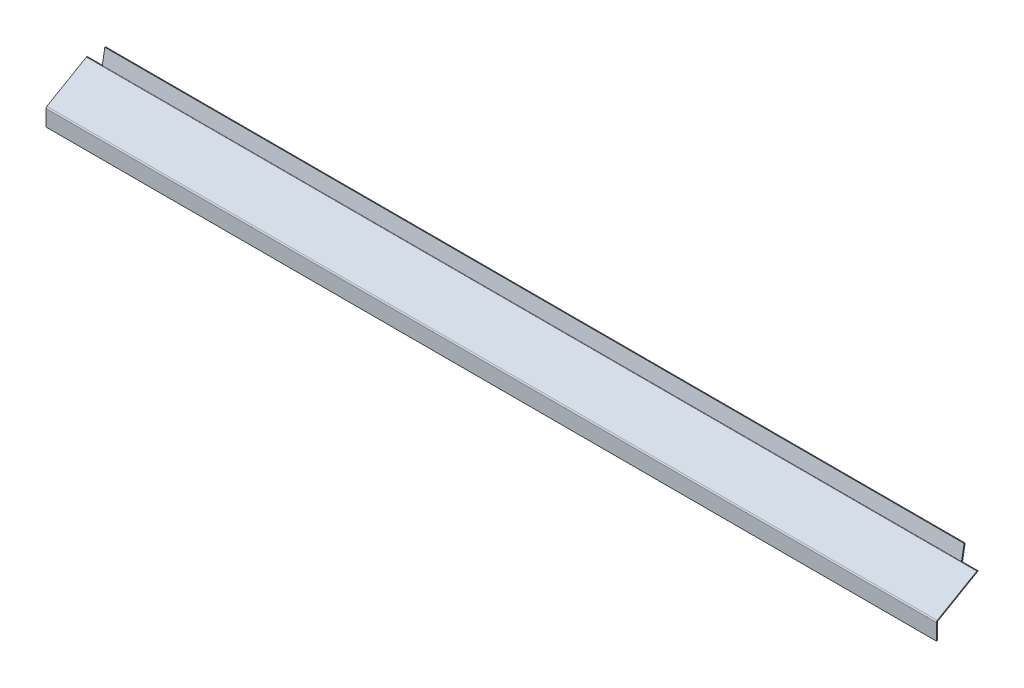
ISO-10303-21;
HEADER;
FILE_DESCRIPTION(('STEP AP214'),'2;1');
FILE_NAME('part.step','',(''),(''),'','','');
FILE_SCHEMA(('AUTOMOTIVE_DESIGN { 1 0 10303 214 1 1 1 1 }'));
ENDSEC;
DATA;
#1=APPLICATION_CONTEXT('core data for automotive mechanical design processes');
#2=APPLICATION_PROTOCOL_DEFINITION('international standard','automotive_design',2000,#1);
#3=PRODUCT_CONTEXT('',#1,'mechanical');
#4=PRODUCT('Part','Part','',(#3));
#5=PRODUCT_RELATED_PRODUCT_CATEGORY('part','',(#4));
#6=PRODUCT_DEFINITION_FORMATION('','',#4);
#7=PRODUCT_DEFINITION_CONTEXT('part definition',#1,'design');
#8=PRODUCT_DEFINITION('design','',#6,#7);
#9=PRODUCT_DEFINITION_SHAPE('','',#8);
#10=(LENGTH_UNIT() NAMED_UNIT(*) SI_UNIT(.MILLI.,.METRE.));
#11=(NAMED_UNIT(*) PLANE_ANGLE_UNIT() SI_UNIT($,.RADIAN.));
#12=(NAMED_UNIT(*) SI_UNIT($,.STERADIAN.) SOLID_ANGLE_UNIT());
#13=UNCERTAINTY_MEASURE_WITH_UNIT(LENGTH_MEASURE(1.E-05),#10,'distance_accuracy_value','');
#14=(GEOMETRIC_REPRESENTATION_CONTEXT(3) GLOBAL_UNCERTAINTY_ASSIGNED_CONTEXT((#13)) GLOBAL_UNIT_ASSIGNED_CONTEXT((#10,
#11,#12)) REPRESENTATION_CONTEXT('',''));
#15=CARTESIAN_POINT('',(0.,0.,0.));
#16=DIRECTION('',(0.,0.,1.));
#17=DIRECTION('',(1.,0.,0.));
#18=AXIS2_PLACEMENT_3D('',#15,#16,#17);
#19=CARTESIAN_POINT('',(-514.999999999999,37.1351085053024,-46.3624559304882));
#20=DIRECTION('',(-1.,0.,0.));
#21=DIRECTION('',(0.,-0.173648177666931,-0.984807753012208));
#22=AXIS2_PLACEMENT_3D('',#19,#20,#21);
#23=CYLINDRICAL_SURFACE('',#22,1.9366);
#24=CARTESIAN_POINT('',(-515.,37.1351085053024,-46.3624559304882));
#25=DIRECTION('',(-1.,0.,0.));
#26=DIRECTION('',(0.,0.,1.));
#27=AXIS2_PLACEMENT_3D('',#24,#25,#26);
#28=CIRCLE('',#27,1.9366);
#29=CARTESIAN_POINT('',(-515.,36.2577170242714,-48.0888984430018));
#30=VERTEX_POINT('',#29);
#31=CARTESIAN_POINT('',(-515.,35.4579637083334,-47.3307559304882));
#32=VERTEX_POINT('',#31);
#33=EDGE_CURVE('E292',#30,#32,#28,.T.);
#34=ORIENTED_EDGE('',*,*,#33,.F.);
#35=DIRECTION('',(-1.,0.,0.));
#36=VECTOR('',#35,1.);
#37=CARTESIAN_POINT('',(-514.999999999999,36.2577170242714,-48.0888984430018));
#38=LINE('',#37,#36);
#39=CARTESIAN_POINT('',(-497.,36.2577170242714,-48.0888984430018));
#40=VERTEX_POINT('',#39);
#41=EDGE_CURVE('E109',#40,#30,#38,.T.);
#42=ORIENTED_EDGE('',*,*,#41,.F.);
#43=CARTESIAN_POINT('',(-497.,37.1351085053024,-46.3624559304882));
#44=DIRECTION('',(1.,0.,0.));
#45=DIRECTION('',(0.,0.,-1.));
#46=AXIS2_PLACEMENT_3D('',#43,#44,#45);
#47=CIRCLE('',#46,1.9366);
#48=CARTESIAN_POINT('',(-497.,36.7988214444325,-48.2696346249717));
#49=VERTEX_POINT('',#48);
#50=EDGE_CURVE('E219',#49,#40,#47,.F.);
#51=ORIENTED_EDGE('',*,*,#50,.F.);
#52=DIRECTION('',(-1.,0.,0.));
#53=VECTOR('',#52,1.);
#54=CARTESIAN_POINT('',(0.,36.7988214444326,-48.2696346249717));
#55=LINE('',#54,#53);
#56=CARTESIAN_POINT('',(497.,36.7988214444326,-48.2696346249717));
#57=VERTEX_POINT('',#56);
#58=EDGE_CURVE('E280',#57,#49,#55,.T.);
#59=ORIENTED_EDGE('',*,*,#58,.F.);
#60=CARTESIAN_POINT('',(497.,37.1351085053023,-46.3624559304882));
#61=DIRECTION('',(-1.,0.,0.));
#62=DIRECTION('',(0.,0.,1.));
#63=AXIS2_PLACEMENT_3D('',#60,#61,#62);
#64=CIRCLE('',#63,1.9366);
#65=CARTESIAN_POINT('',(497.,36.2577170242714,-48.0888984430018));
#66=VERTEX_POINT('',#65);
#67=EDGE_CURVE('E260',#57,#66,#64,.T.);
#68=ORIENTED_EDGE('',*,*,#67,.T.);
#69=DIRECTION('',(1.,0.,0.));
#70=VECTOR('',#69,1.);
#71=CARTESIAN_POINT('',(496.999999999999,36.2577170242714,-48.0888984430018));
#72=LINE('',#71,#70);
#73=CARTESIAN_POINT('',(514.999999999999,36.2577170242719,-48.0888984430021));
#74=VERTEX_POINT('',#73);
#75=EDGE_CURVE('E270',#66,#74,#72,.T.);
#76=ORIENTED_EDGE('',*,*,#75,.T.);
#77=CARTESIAN_POINT('',(514.999999999999,37.1351085053024,-46.3624559304882));
#78=DIRECTION('',(-1.,0.,0.));
#79=DIRECTION('',(0.,0.,1.));
#80=AXIS2_PLACEMENT_3D('',#77,#78,#79);
#81=CIRCLE('',#80,1.9366);
#82=CARTESIAN_POINT('',(515.,35.4579637083334,-47.3307559304882));
#83=VERTEX_POINT('',#82);
#84=EDGE_CURVE('E291',#83,#74,#81,.F.);
#85=ORIENTED_EDGE('',*,*,#84,.F.);
#86=DIRECTION('',(-1.,0.,0.));
#87=VECTOR('',#86,1.);
#88=CARTESIAN_POINT('',(-514.999999999999,35.4579637083334,-47.3307559304882));
#89=LINE('',#88,#87);
#90=EDGE_CURVE('E287',#32,#83,#89,.F.);
#91=ORIENTED_EDGE('',*,*,#90,.F.);
#92=EDGE_LOOP('',(#34,#42,#51,#59,#68,#76,#85,#91));
#93=FACE_BOUND('',#92,.T.);
#94=ADVANCED_FACE('F86',(#93),#23,.T.);
#95=CARTESIAN_POINT('',(-514.999999999999,37.1351085053024,-46.3624559304882));
#96=DIRECTION('',(-1.,0.,0.));
#97=DIRECTION('',(0.,-0.173648177666931,-0.984807753012208));
#98=AXIS2_PLACEMENT_3D('',#95,#96,#97);
#99=CYLINDRICAL_SURFACE('',#98,0.736600000000003);
#100=DIRECTION('',(-1.,0.,0.));
#101=VECTOR('',#100,1.);
#102=CARTESIAN_POINT('',(-514.999999999999,36.8013862266039,-47.0191209902412));
#103=LINE('',#102,#101);
#104=CARTESIAN_POINT('',(-497.,36.8013862266039,-47.0191209902412));
#105=VERTEX_POINT('',#104);
#106=CARTESIAN_POINT('',(-515.,36.8013862266039,-47.0191209902412));
#107=VERTEX_POINT('',#106);
#108=EDGE_CURVE('E230',#105,#107,#103,.T.);
#109=ORIENTED_EDGE('',*,*,#108,.T.);
#110=CARTESIAN_POINT('',(-515.,37.1351085053024,-46.3624559304882));
#111=DIRECTION('',(-1.,0.,0.));
#112=DIRECTION('',(0.,0.,1.));
#113=AXIS2_PLACEMENT_3D('',#110,#111,#112);
#114=CIRCLE('',#113,0.736600000000003);
#115=CARTESIAN_POINT('',(-515.,36.4971941928747,-46.7307559304882));
#116=VERTEX_POINT('',#115);
#117=EDGE_CURVE('E284',#107,#116,#114,.T.);
#118=ORIENTED_EDGE('',*,*,#117,.T.);
#119=DIRECTION('',(-1.,0.,0.));
#120=VECTOR('',#119,1.);
#121=CARTESIAN_POINT('',(-514.999999999999,36.4971941928747,-46.7307559304882));
#122=LINE('',#121,#120);
#123=CARTESIAN_POINT('',(515.,36.4971941928747,-46.7307559304882));
#124=VERTEX_POINT('',#123);
#125=EDGE_CURVE('E303',#116,#124,#122,.F.);
#126=ORIENTED_EDGE('',*,*,#125,.T.);
#127=CARTESIAN_POINT('',(515.,37.1351085053024,-46.3624559304882));
#128=DIRECTION('',(-1.,0.,0.));
#129=DIRECTION('',(0.,0.,1.));
#130=AXIS2_PLACEMENT_3D('',#127,#128,#129);
#131=CIRCLE('',#130,0.736600000000003);
#132=CARTESIAN_POINT('',(515.,36.8013862266044,-47.0191209902414));
#133=VERTEX_POINT('',#132);
#134=EDGE_CURVE('E299',#124,#133,#131,.F.);
#135=ORIENTED_EDGE('',*,*,#134,.T.);
#136=DIRECTION('',(1.,0.,0.));
#137=VECTOR('',#136,1.);
#138=CARTESIAN_POINT('',(-1030.00253631797,36.8013862266039,-47.0191209902411));
#139=LINE('',#138,#137);
#140=CARTESIAN_POINT('',(497.,36.8013862266039,-47.0191209902412));
#141=VERTEX_POINT('',#140);
#142=EDGE_CURVE('E264',#141,#133,#139,.T.);
#143=ORIENTED_EDGE('',*,*,#142,.F.);
#144=CARTESIAN_POINT('',(497.,37.1351085053023,-46.3624559304882));
#145=DIRECTION('',(1.,0.,0.));
#146=DIRECTION('',(0.,0.,-1.));
#147=AXIS2_PLACEMENT_3D('',#144,#145,#146);
#148=CIRCLE('',#147,0.7366);
#149=CARTESIAN_POINT('',(497.,37.0071992576329,-47.087865321357));
#150=VERTEX_POINT('',#149);
#151=EDGE_CURVE('E253',#150,#141,#148,.F.);
#152=ORIENTED_EDGE('',*,*,#151,.F.);
#153=DIRECTION('',(1.,0.,0.));
#154=VECTOR('',#153,1.);
#155=CARTESIAN_POINT('',(515.,37.0071992576329,-47.087865321357));
#156=LINE('',#155,#154);
#157=CARTESIAN_POINT('',(-497.,37.0071992576329,-47.087865321357));
#158=VERTEX_POINT('',#157);
#159=EDGE_CURVE('E279',#150,#158,#156,.F.);
#160=ORIENTED_EDGE('',*,*,#159,.T.);
#161=CARTESIAN_POINT('',(-497.,37.1351085053024,-46.3624559304882));
#162=DIRECTION('',(-1.,0.,0.));
#163=DIRECTION('',(0.,0.,1.));
#164=AXIS2_PLACEMENT_3D('',#161,#162,#163);
#165=CIRCLE('',#164,0.736600000000003);
#166=EDGE_CURVE('E234',#158,#105,#165,.T.);
#167=ORIENTED_EDGE('',*,*,#166,.T.);
#168=EDGE_LOOP('',(#109,#118,#126,#135,#143,#152,#160,#167));
#169=FACE_BOUND('',#168,.T.);
#170=ADVANCED_FACE('F451',(#169),#99,.F.);
#171=CARTESIAN_POINT('',(0.,-8.13659562341442,-40.3463082065226));
#172=DIRECTION('',(0.,-0.173648177666931,-0.984807753012208));
#173=DIRECTION('',(0.,0.984807753012208,-0.173648177666931));
#174=AXIS2_PLACEMENT_3D('',#171,#172,#173);
#175=PLANE('',#174);
#176=DIRECTION('',(-1.,0.,0.));
#177=VECTOR('',#176,1.);
#178=CARTESIAN_POINT('',(0.,53.4852741612502,-51.2119064512627));
#179=LINE('',#178,#177);
#180=CARTESIAN_POINT('',(497.,53.4852741612502,-51.2119064512627));
#181=VERTEX_POINT('',#180);
#182=CARTESIAN_POINT('',(-497.,53.4852741612502,-51.2119064512627));
#183=VERTEX_POINT('',#182);
#184=EDGE_CURVE('E101',#181,#183,#179,.T.);
#185=ORIENTED_EDGE('',*,*,#184,.F.);
#186=DIRECTION('',(0.,0.984807753012208,-0.17364817766693));
#187=VECTOR('',#186,1.);
#188=CARTESIAN_POINT('',(497.,-8.1365956234144,-40.3463082065226));
#189=LINE('',#188,#187);
#190=EDGE_CURVE('E276',#181,#57,#189,.F.);
#191=ORIENTED_EDGE('',*,*,#190,.T.);
#192=ORIENTED_EDGE('',*,*,#58,.T.);
#193=DIRECTION('',(0.,0.984807753012208,-0.173648177666931));
#194=VECTOR('',#193,1.);
#195=CARTESIAN_POINT('',(-497.,59.9107568811308,-52.3448924188536));
#196=LINE('',#195,#194);
#197=EDGE_CURVE('E220',#183,#49,#196,.F.);
#198=ORIENTED_EDGE('',*,*,#197,.F.);
#199=EDGE_LOOP('',(#185,#191,#192,#198));
#200=FACE_BOUND('',#199,.T.);
#201=ADVANCED_FACE('F475',(#200),#175,.T.);
#202=CARTESIAN_POINT('',(0.,-7.9282178102141,-39.1645389029079));
#203=DIRECTION('',(0.,-0.173648177666931,-0.984807753012208));
#204=DIRECTION('',(0.,0.984807753012208,-0.173648177666931));
#205=AXIS2_PLACEMENT_3D('',#202,#203,#204);
#206=PLANE('',#205);
#207=DIRECTION('',(0.,-0.984807753012208,0.17364817766693));
#208=VECTOR('',#207,1.);
#209=CARTESIAN_POINT('',(497.,36.4515034247715,-46.9898811529564));
#210=LINE('',#209,#208);
#211=CARTESIAN_POINT('',(497.,53.6936519744505,-50.0301371476481));
#212=VERTEX_POINT('',#211);
#213=EDGE_CURVE('E210',#212,#150,#210,.T.);
#214=ORIENTED_EDGE('',*,*,#213,.F.);
#215=DIRECTION('',(1.,0.,0.));
#216=VECTOR('',#215,1.);
#217=CARTESIAN_POINT('',(-515.,53.6936519744505,-50.0301371476481));
#218=LINE('',#217,#216);
#219=CARTESIAN_POINT('',(-497.,53.6936519744505,-50.0301371476481));
#220=VERTEX_POINT('',#219);
#221=EDGE_CURVE('E199',#220,#212,#218,.T.);
#222=ORIENTED_EDGE('',*,*,#221,.F.);
#223=DIRECTION('',(0.,-0.984807753012208,0.173648177666931));
#224=VECTOR('',#223,1.);
#225=CARTESIAN_POINT('',(-497.,-7.9282178102141,-39.1645389029079));
#226=LINE('',#225,#224);
#227=EDGE_CURVE('E208',#220,#158,#226,.T.);
#228=ORIENTED_EDGE('',*,*,#227,.T.);
#229=ORIENTED_EDGE('',*,*,#159,.F.);
#230=EDGE_LOOP('',(#214,#222,#228,#229));
#231=FACE_BOUND('',#230,.T.);
#232=ADVANCED_FACE('F206',(#231),#206,.F.);
#233=CARTESIAN_POINT('',(-515.,37.1351085053024,-46.3624559304882));
#234=DIRECTION('',(1.,0.,0.));
#235=DIRECTION('',(0.,0.,-1.));
#236=AXIS2_PLACEMENT_3D('',#233,#234,#235);
#237=PLANE('',#236);
#238=ORIENTED_EDGE('',*,*,#117,.F.);
#239=DIRECTION('',(0.,-0.453057668610422,-0.891481210633903));
#240=VECTOR('',#239,1.);
#241=CARTESIAN_POINT('',(-515.,36.2577170242714,-48.0888984430018));
#242=LINE('',#241,#240);
#243=EDGE_CURVE('E240',#30,#107,#242,.F.);
#244=ORIENTED_EDGE('',*,*,#243,.F.);
#245=ORIENTED_EDGE('',*,*,#33,.T.);
#246=DIRECTION('',(0.,-0.866025403784439,-0.5));
#247=VECTOR('',#246,1.);
#248=CARTESIAN_POINT('',(-515.,36.4971941928747,-46.7307559304882));
#249=LINE('',#248,#247);
#250=EDGE_CURVE('E296',#116,#32,#249,.T.);
#251=ORIENTED_EDGE('',*,*,#250,.F.);
#252=EDGE_LOOP('',(#238,#244,#245,#251));
#253=FACE_BOUND('',#252,.T.);
#254=ADVANCED_FACE('F479',(#253),#237,.F.);
#255=CARTESIAN_POINT('',(515.,37.1351085053024,-46.3624559304882));
#256=DIRECTION('',(1.,0.,0.));
#257=DIRECTION('',(0.,0.,-1.));
#258=AXIS2_PLACEMENT_3D('',#255,#256,#257);
#259=PLANE('',#258);
#260=ORIENTED_EDGE('',*,*,#84,.T.);
#261=DIRECTION('',(0.,-0.453057668610419,-0.891481210633904));
#262=VECTOR('',#261,1.);
#263=CARTESIAN_POINT('',(515.,36.2577170242714,-48.0888984430018));
#264=LINE('',#263,#262);
#265=EDGE_CURVE('E267',#133,#74,#264,.T.);
#266=ORIENTED_EDGE('',*,*,#265,.F.);
#267=ORIENTED_EDGE('',*,*,#134,.F.);
#268=DIRECTION('',(6.02890591705213E-13,-0.866025403784439,-0.5));
#269=VECTOR('',#268,1.);
#270=CARTESIAN_POINT('',(515.,36.4971941928747,-46.7307559304882));
#271=LINE('',#270,#269);
#272=EDGE_CURVE('E308',#124,#83,#271,.T.);
#273=ORIENTED_EDGE('',*,*,#272,.T.);
#274=EDGE_LOOP('',(#260,#266,#267,#273));
#275=FACE_BOUND('',#274,.T.);
#276=ADVANCED_FACE('F456',(#275),#259,.T.);
#277=CARTESIAN_POINT('',(515.,37.4521796769726,-48.3848393094365));
#278=DIRECTION('',(-1.,0.,0.));
#279=DIRECTION('',(0.,0.,1.));
#280=AXIS2_PLACEMENT_3D('',#277,#278,#279);
#281=PLANE('',#280);
#282=ORIENTED_EDGE('',*,*,#272,.F.);
#283=DIRECTION('',(0.,0.500000000000004,-0.866025403784437));
#284=VECTOR('',#283,1.);
#285=CARTESIAN_POINT('',(515.,6.79147459621551,4.72105968631958));
#286=LINE('',#285,#284);
#287=CARTESIAN_POINT('',(515.,10.0762279426287,-0.968299999999958));
#288=VERTEX_POINT('',#287);
#289=EDGE_CURVE('E320',#288,#124,#286,.T.);
#290=ORIENTED_EDGE('',*,*,#289,.F.);
#291=DIRECTION('',(0.,-0.866025403784437,-0.500000000000004));
#292=VECTOR('',#291,1.);
#293=CARTESIAN_POINT('',(515.,9.03699745808741,-1.56829999999996));
#294=LINE('',#293,#292);
#295=CARTESIAN_POINT('',(515.,9.03699745808745,-1.56829999999989));
#296=VERTEX_POINT('',#295);
#297=EDGE_CURVE('E335',#296,#288,#294,.F.);
#298=ORIENTED_EDGE('',*,*,#297,.F.);
#299=DIRECTION('',(0.,-0.500000000000004,0.866025403784437));
#300=VECTOR('',#299,1.);
#301=CARTESIAN_POINT('',(515.,36.4129491924313,-48.9848393094365));
#302=LINE('',#301,#300);
#303=EDGE_CURVE('E327',#296,#83,#302,.F.);
#304=ORIENTED_EDGE('',*,*,#303,.T.);
#305=EDGE_LOOP('',(#282,#290,#298,#304));
#306=FACE_BOUND('',#305,.T.);
#307=ADVANCED_FACE('F445',(#306),#281,.F.);
#308=CARTESIAN_POINT('',(-515.,9.86358983848621,-0.599999999999995));
#309=DIRECTION('',(1.,0.,0.));
#310=DIRECTION('',(0.,0.,-1.));
#311=AXIS2_PLACEMENT_3D('',#308,#309,#310);
#312=PLANE('',#311);
#313=ORIENTED_EDGE('',*,*,#250,.T.);
#314=DIRECTION('',(0.,0.500000000000004,-0.866025403784437));
#315=VECTOR('',#314,1.);
#316=CARTESIAN_POINT('',(-515.,8.82435935394489,-1.2));
#317=LINE('',#316,#315);
#318=CARTESIAN_POINT('',(-515.,9.03699745808745,-1.56830000000004));
#319=VERTEX_POINT('',#318);
#320=EDGE_CURVE('E324',#32,#319,#317,.F.);
#321=ORIENTED_EDGE('',*,*,#320,.T.);
#322=DIRECTION('',(0.,-0.866025403784437,-0.500000000000004));
#323=VECTOR('',#322,1.);
#324=CARTESIAN_POINT('',(-515.,10.0762279426288,-0.968299999999992));
#325=LINE('',#324,#323);
#326=CARTESIAN_POINT('',(-515.,10.0762279426288,-0.968300000000031));
#327=VERTEX_POINT('',#326);
#328=EDGE_CURVE('E312',#319,#327,#325,.F.);
#329=ORIENTED_EDGE('',*,*,#328,.T.);
#330=DIRECTION('',(0.,-0.500000000000004,0.866025403784437));
#331=VECTOR('',#330,1.);
#332=CARTESIAN_POINT('',(-515.,6.79147459621551,4.72105968631958));
#333=LINE('',#332,#331);
#334=EDGE_CURVE('E316',#116,#327,#333,.T.);
#335=ORIENTED_EDGE('',*,*,#334,.F.);
#336=EDGE_LOOP('',(#313,#321,#329,#335));
#337=FACE_BOUND('',#336,.T.);
#338=ADVANCED_FACE('F435',(#337),#312,.F.);
#339=CARTESIAN_POINT('',(0.,6.79147459621551,4.72105968631958));
#340=DIRECTION('',(0.,-0.866025403784437,-0.500000000000004));
#341=DIRECTION('',(0.,0.500000000000004,-0.866025403784437));
#342=AXIS2_PLACEMENT_3D('',#339,#340,#341);
#343=PLANE('',#342);
#344=ORIENTED_EDGE('',*,*,#125,.F.);
#345=ORIENTED_EDGE('',*,*,#334,.T.);
#346=DIRECTION('',(1.,0.,0.));
#347=VECTOR('',#346,1.);
#348=CARTESIAN_POINT('',(-515.,10.0762279426288,-0.968299999999992));
#349=LINE('',#348,#347);
#350=EDGE_CURVE('E331',#288,#327,#349,.F.);
#351=ORIENTED_EDGE('',*,*,#350,.F.);
#352=ORIENTED_EDGE('',*,*,#289,.T.);
#353=EDGE_LOOP('',(#344,#345,#351,#352));
#354=FACE_BOUND('',#353,.T.);
#355=ADVANCED_FACE('F448',(#354),#343,.F.);
#356=CARTESIAN_POINT('',(0.,5.75224411167419,4.12105968631958));
#357=DIRECTION('',(0.,-0.866025403784437,-0.500000000000004));
#358=DIRECTION('',(0.,0.500000000000004,-0.866025403784437));
#359=AXIS2_PLACEMENT_3D('',#356,#357,#358);
#360=PLANE('',#359);
#361=ORIENTED_EDGE('',*,*,#320,.F.);
#362=ORIENTED_EDGE('',*,*,#90,.T.);
#363=ORIENTED_EDGE('',*,*,#303,.F.);
#364=DIRECTION('',(1.,0.,0.));
#365=VECTOR('',#364,1.);
#366=CARTESIAN_POINT('',(-515.,9.03699745808743,-1.5683));
#367=LINE('',#366,#365);
#368=EDGE_CURVE('E339',#319,#296,#367,.T.);
#369=ORIENTED_EDGE('',*,*,#368,.F.);
#370=EDGE_LOOP('',(#361,#362,#363,#369));
#371=FACE_BOUND('',#370,.T.);
#372=ADVANCED_FACE('F439',(#371),#360,.T.);
#373=CARTESIAN_POINT('',(515.,10.21,-1.2));
#374=DIRECTION('',(1.,0.,0.));
#375=DIRECTION('',(0.,0.,-1.));
#376=AXIS2_PLACEMENT_3D('',#373,#374,#375);
#377=PLANE('',#376);
#378=DIRECTION('',(0.,1.,0.));
#379=VECTOR('',#378,1.);
#380=CARTESIAN_POINT('',(515.,10.21,-1.2));
#381=LINE('',#380,#379);
#382=CARTESIAN_POINT('',(515.,-10.21,-1.2));
#383=VERTEX_POINT('',#382);
#384=CARTESIAN_POINT('',(515.,8.3990831456598,-1.19999999999987));
#385=VERTEX_POINT('',#384);
#386=EDGE_CURVE('E376',#383,#385,#381,.T.);
#387=ORIENTED_EDGE('',*,*,#386,.T.);
#388=DIRECTION('',(0.,0.,1.));
#389=VECTOR('',#388,1.);
#390=CARTESIAN_POINT('',(515.,8.3990831456598,-1.19999999999987));
#391=LINE('',#390,#389);
#392=CARTESIAN_POINT('',(515.,8.3990831456598,1.32272665043232E-13));
#393=VERTEX_POINT('',#392);
#394=EDGE_CURVE('E354',#385,#393,#391,.T.);
#395=ORIENTED_EDGE('',*,*,#394,.T.);
#396=DIRECTION('',(0.,1.,0.));
#397=VECTOR('',#396,1.);
#398=CARTESIAN_POINT('',(515.,10.21,0.));
#399=LINE('',#398,#397);
#400=CARTESIAN_POINT('',(515.,-10.21,0.));
#401=VERTEX_POINT('',#400);
#402=EDGE_CURVE('E372',#401,#393,#399,.T.);
#403=ORIENTED_EDGE('',*,*,#402,.F.);
#404=DIRECTION('',(0.,0.,1.));
#405=VECTOR('',#404,1.);
#406=CARTESIAN_POINT('',(515.,-10.21,-1.2));
#407=LINE('',#406,#405);
#408=EDGE_CURVE('E95',#383,#401,#407,.T.);
#409=ORIENTED_EDGE('',*,*,#408,.F.);
#410=EDGE_LOOP('',(#387,#395,#403,#409));
#411=FACE_BOUND('',#410,.T.);
#412=ADVANCED_FACE('F88',(#411),#377,.T.);
#413=CARTESIAN_POINT('',(0.,0.,-1.2));
#414=DIRECTION('',(0.,0.,1.));
#415=DIRECTION('',(1.,0.,0.));
#416=AXIS2_PLACEMENT_3D('',#413,#414,#415);
#417=PLANE('',#416);
#418=DIRECTION('',(1.,0.,0.));
#419=VECTOR('',#418,1.);
#420=CARTESIAN_POINT('',(515.,8.3990831456598,-1.19999999999987));
#421=LINE('',#420,#419);
#422=CARTESIAN_POINT('',(-515.,8.3990831456598,-1.20000000000002));
#423=VERTEX_POINT('',#422);
#424=EDGE_CURVE('E362',#385,#423,#421,.F.);
#425=ORIENTED_EDGE('',*,*,#424,.F.);
#426=ORIENTED_EDGE('',*,*,#386,.F.);
#427=DIRECTION('',(1.,0.,0.));
#428=VECTOR('',#427,1.);
#429=CARTESIAN_POINT('',(-515.,-10.21,-1.2));
#430=LINE('',#429,#428);
#431=CARTESIAN_POINT('',(-515.,-10.21,-1.2));
#432=VERTEX_POINT('',#431);
#433=EDGE_CURVE('E384',#432,#383,#430,.T.);
#434=ORIENTED_EDGE('',*,*,#433,.F.);
#435=DIRECTION('',(0.,-1.,0.));
#436=VECTOR('',#435,1.);
#437=CARTESIAN_POINT('',(-515.,10.21,-1.2));
#438=LINE('',#437,#436);
#439=EDGE_CURVE('E380',#423,#432,#438,.T.);
#440=ORIENTED_EDGE('',*,*,#439,.F.);
#441=EDGE_LOOP('',(#425,#426,#434,#440));
#442=FACE_BOUND('',#441,.T.);
#443=ADVANCED_FACE('F425',(#442),#417,.F.);
#444=CARTESIAN_POINT('',(0.,0.,0.));
#445=DIRECTION('',(0.,0.,1.));
#446=DIRECTION('',(1.,0.,0.));
#447=AXIS2_PLACEMENT_3D('',#444,#445,#446);
#448=PLANE('',#447);
#449=ORIENTED_EDGE('',*,*,#402,.T.);
#450=DIRECTION('',(1.,0.,0.));
#451=VECTOR('',#450,1.);
#452=CARTESIAN_POINT('',(515.,8.3990831456598,1.32272665043232E-13));
#453=LINE('',#452,#451);
#454=CARTESIAN_POINT('',(-515.,8.3990831456598,0.));
#455=VERTEX_POINT('',#454);
#456=EDGE_CURVE('E345',#393,#455,#453,.F.);
#457=ORIENTED_EDGE('',*,*,#456,.T.);
#458=DIRECTION('',(0.,-1.,0.));
#459=VECTOR('',#458,1.);
#460=CARTESIAN_POINT('',(-515.,10.21,0.));
#461=LINE('',#460,#459);
#462=CARTESIAN_POINT('',(-515.,-10.21,0.));
#463=VERTEX_POINT('',#462);
#464=EDGE_CURVE('E392',#455,#463,#461,.T.);
#465=ORIENTED_EDGE('',*,*,#464,.T.);
#466=DIRECTION('',(1.,0.,0.));
#467=VECTOR('',#466,1.);
#468=CARTESIAN_POINT('',(-515.,-10.21,0.));
#469=LINE('',#468,#467);
#470=EDGE_CURVE('E381',#463,#401,#469,.T.);
#471=ORIENTED_EDGE('',*,*,#470,.T.);
#472=EDGE_LOOP('',(#449,#457,#465,#471));
#473=FACE_BOUND('',#472,.T.);
#474=ADVANCED_FACE('F413',(#473),#448,.T.);
#475=CARTESIAN_POINT('',(-515.,-10.21,-1.2));
#476=DIRECTION('',(0.,-1.,0.));
#477=DIRECTION('',(0.,0.,-1.));
#478=AXIS2_PLACEMENT_3D('',#475,#476,#477);
#479=PLANE('',#478);
#480=ORIENTED_EDGE('',*,*,#470,.F.);
#481=DIRECTION('',(0.,0.,1.));
#482=VECTOR('',#481,1.);
#483=CARTESIAN_POINT('',(-515.,-10.21,-1.2));
#484=LINE('',#483,#482);
#485=EDGE_CURVE('E388',#432,#463,#484,.T.);
#486=ORIENTED_EDGE('',*,*,#485,.F.);
#487=ORIENTED_EDGE('',*,*,#433,.T.);
#488=ORIENTED_EDGE('',*,*,#408,.T.);
#489=EDGE_LOOP('',(#480,#486,#487,#488));
#490=FACE_BOUND('',#489,.T.);
#491=ADVANCED_FACE('F410',(#490),#479,.T.);
#492=CARTESIAN_POINT('',(-515.,10.21,-1.2));
#493=DIRECTION('',(-1.,0.,0.));
#494=DIRECTION('',(0.,0.,1.));
#495=AXIS2_PLACEMENT_3D('',#492,#493,#494);
#496=PLANE('',#495);
#497=DIRECTION('',(0.,0.,1.));
#498=VECTOR('',#497,1.);
#499=CARTESIAN_POINT('',(-515.,8.3990831456598,-1.20000000000002));
#500=LINE('',#499,#498);
#501=EDGE_CURVE('E368',#423,#455,#500,.T.);
#502=ORIENTED_EDGE('',*,*,#501,.F.);
#503=ORIENTED_EDGE('',*,*,#439,.T.);
#504=ORIENTED_EDGE('',*,*,#485,.T.);
#505=ORIENTED_EDGE('',*,*,#464,.F.);
#506=EDGE_LOOP('',(#502,#503,#504,#505));
#507=FACE_BOUND('',#506,.T.);
#508=ADVANCED_FACE('F406',(#507),#496,.T.);
#509=CARTESIAN_POINT('',(-515.,8.3990831456598,-1.93660000000006));
#510=DIRECTION('',(-1.,0.,0.));
#511=DIRECTION('',(0.,0.,1.));
#512=AXIS2_PLACEMENT_3D('',#509,#510,#511);
#513=PLANE('',#512);
#514=ORIENTED_EDGE('',*,*,#328,.F.);
#515=CARTESIAN_POINT('',(-515.,8.3990831456598,-1.93660000000006));
#516=DIRECTION('',(1.,0.,0.));
#517=DIRECTION('',(0.,0.,-1.));
#518=AXIS2_PLACEMENT_3D('',#515,#516,#517);
#519=CIRCLE('',#518,0.736600000000041);
#520=EDGE_CURVE('E358',#423,#319,#519,.F.);
#521=ORIENTED_EDGE('',*,*,#520,.F.);
#522=ORIENTED_EDGE('',*,*,#501,.T.);
#523=CARTESIAN_POINT('',(-515.,8.3990831456598,-1.93660000000006));
#524=DIRECTION('',(1.,0.,0.));
#525=DIRECTION('',(0.,0.,-1.));
#526=AXIS2_PLACEMENT_3D('',#523,#524,#525);
#527=CIRCLE('',#526,1.93660000000004);
#528=EDGE_CURVE('E349',#455,#327,#527,.F.);
#529=ORIENTED_EDGE('',*,*,#528,.T.);
#530=EDGE_LOOP('',(#514,#521,#522,#529));
#531=FACE_BOUND('',#530,.T.);
#532=ADVANCED_FACE('F432',(#531),#513,.T.);
#533=CARTESIAN_POINT('',(515.,8.3990831456598,-1.93659999999991));
#534=DIRECTION('',(-1.,0.,0.));
#535=DIRECTION('',(0.,0.,1.));
#536=AXIS2_PLACEMENT_3D('',#533,#534,#535);
#537=PLANE('',#536);
#538=CARTESIAN_POINT('',(515.,8.3990831456598,-1.93659999999991));
#539=DIRECTION('',(1.,0.,0.));
#540=DIRECTION('',(0.,0.,-1.));
#541=AXIS2_PLACEMENT_3D('',#538,#539,#540);
#542=CIRCLE('',#541,0.736600000000041);
#543=EDGE_CURVE('E319',#296,#385,#542,.T.);
#544=ORIENTED_EDGE('',*,*,#543,.F.);
#545=ORIENTED_EDGE('',*,*,#297,.T.);
#546=CARTESIAN_POINT('',(515.,8.3990831456598,-1.93659999999991));
#547=DIRECTION('',(1.,0.,0.));
#548=DIRECTION('',(0.,0.,-1.));
#549=AXIS2_PLACEMENT_3D('',#546,#547,#548);
#550=CIRCLE('',#549,1.93660000000004);
#551=EDGE_CURVE('E350',#288,#393,#550,.T.);
#552=ORIENTED_EDGE('',*,*,#551,.T.);
#553=ORIENTED_EDGE('',*,*,#394,.F.);
#554=EDGE_LOOP('',(#544,#545,#552,#553));
#555=FACE_BOUND('',#554,.T.);
#556=ADVANCED_FACE('F418',(#555),#537,.F.);
#557=CARTESIAN_POINT('',(515.,8.3990831456598,-1.93659999999991));
#558=DIRECTION('',(1.,0.,0.));
#559=DIRECTION('',(0.,0.866025403784437,0.500000000000004));
#560=AXIS2_PLACEMENT_3D('',#557,#558,#559);
#561=CYLINDRICAL_SURFACE('',#560,1.93660000000004);
#562=ORIENTED_EDGE('',*,*,#456,.F.);
#563=ORIENTED_EDGE('',*,*,#551,.F.);
#564=ORIENTED_EDGE('',*,*,#350,.T.);
#565=ORIENTED_EDGE('',*,*,#528,.F.);
#566=EDGE_LOOP('',(#562,#563,#564,#565));
#567=FACE_BOUND('',#566,.T.);
#568=ADVANCED_FACE('F415',(#567),#561,.T.);
#569=CARTESIAN_POINT('',(515.,8.3990831456598,-1.93659999999991));
#570=DIRECTION('',(1.,0.,0.));
#571=DIRECTION('',(0.,0.866025403784437,0.500000000000004));
#572=AXIS2_PLACEMENT_3D('',#569,#570,#571);
#573=CYLINDRICAL_SURFACE('',#572,0.736600000000041);
#574=ORIENTED_EDGE('',*,*,#424,.T.);
#575=ORIENTED_EDGE('',*,*,#520,.T.);
#576=ORIENTED_EDGE('',*,*,#368,.T.);
#577=ORIENTED_EDGE('',*,*,#543,.T.);
#578=EDGE_LOOP('',(#574,#575,#576,#577));
#579=FACE_BOUND('',#578,.T.);
#580=ADVANCED_FACE('F428',(#579),#573,.F.);
#581=CARTESIAN_POINT('',(497.,36.4515034247715,-46.9898811529564));
#582=DIRECTION('',(1.,0.,0.));
#583=DIRECTION('',(0.,-0.984807753012208,0.17364817766693));
#584=AXIS2_PLACEMENT_3D('',#581,#582,#583);
#585=PLANE('',#584);
#586=DIRECTION('',(0.,-0.173648177666931,-0.984807753012208));
#587=VECTOR('',#586,1.);
#588=CARTESIAN_POINT('',(497.,53.6936519744505,-50.0301371476481));
#589=LINE('',#588,#587);
#590=EDGE_CURVE('E225',#212,#181,#589,.T.);
#591=ORIENTED_EDGE('',*,*,#590,.F.);
#592=ORIENTED_EDGE('',*,*,#213,.T.);
#593=DIRECTION('',(-2.29313854100001E-13,0.173648177666952,0.984807753012204));
#594=VECTOR('',#593,1.);
#595=CARTESIAN_POINT('',(497.,36.7988214444325,-48.2696346249717));
#596=LINE('',#595,#594);
#597=EDGE_CURVE('E247',#57,#150,#596,.T.);
#598=ORIENTED_EDGE('',*,*,#597,.F.);
#599=ORIENTED_EDGE('',*,*,#190,.F.);
#600=EDGE_LOOP('',(#591,#592,#598,#599));
#601=FACE_BOUND('',#600,.T.);
#602=ADVANCED_FACE('F471',(#601),#585,.T.);
#603=CARTESIAN_POINT('',(506.,36.2577170242714,-48.0888984430018));
#604=DIRECTION('',(0.,0.891481210633904,-0.453057668610419));
#605=DIRECTION('',(1.,0.,0.));
#606=AXIS2_PLACEMENT_3D('',#603,#604,#605);
#607=PLANE('',#606);
#608=DIRECTION('',(0.,-0.453057668610415,-0.891481210633907));
#609=VECTOR('',#608,1.);
#610=CARTESIAN_POINT('',(497.,36.2577170242714,-48.0888984430018));
#611=LINE('',#610,#609);
#612=EDGE_CURVE('E256',#141,#66,#611,.T.);
#613=ORIENTED_EDGE('',*,*,#612,.F.);
#614=ORIENTED_EDGE('',*,*,#142,.T.);
#615=ORIENTED_EDGE('',*,*,#265,.T.);
#616=ORIENTED_EDGE('',*,*,#75,.F.);
#617=EDGE_LOOP('',(#613,#614,#615,#616));
#618=FACE_BOUND('',#617,.T.);
#619=ADVANCED_FACE('F459',(#618),#607,.T.);
#620=CARTESIAN_POINT('',(497.,37.1351085053023,-46.3624559304882));
#621=DIRECTION('',(1.,0.,0.));
#622=DIRECTION('',(0.,0.,-1.));
#623=AXIS2_PLACEMENT_3D('',#620,#621,#622);
#624=PLANE('',#623);
#625=ORIENTED_EDGE('',*,*,#597,.T.);
#626=ORIENTED_EDGE('',*,*,#151,.T.);
#627=ORIENTED_EDGE('',*,*,#612,.T.);
#628=ORIENTED_EDGE('',*,*,#67,.F.);
#629=EDGE_LOOP('',(#625,#626,#627,#628));
#630=FACE_BOUND('',#629,.T.);
#631=ADVANCED_FACE('F467',(#630),#624,.T.);
#632=CARTESIAN_POINT('',(-506.,36.2577170242714,-48.0888984430018));
#633=DIRECTION('',(0.,-0.891481210633903,0.453057668610422));
#634=DIRECTION('',(-1.,0.,0.));
#635=AXIS2_PLACEMENT_3D('',#632,#633,#634);
#636=PLANE('',#635);
#637=DIRECTION('',(0.,-0.453057668610422,-0.891481210633903));
#638=VECTOR('',#637,1.);
#639=CARTESIAN_POINT('',(-497.,36.2577170242714,-48.0888984430018));
#640=LINE('',#639,#638);
#641=EDGE_CURVE('E243',#40,#105,#640,.F.);
#642=ORIENTED_EDGE('',*,*,#641,.F.);
#643=ORIENTED_EDGE('',*,*,#41,.T.);
#644=ORIENTED_EDGE('',*,*,#243,.T.);
#645=ORIENTED_EDGE('',*,*,#108,.F.);
#646=EDGE_LOOP('',(#642,#643,#644,#645));
#647=FACE_BOUND('',#646,.T.);
#648=ADVANCED_FACE('F480',(#647),#636,.F.);
#649=CARTESIAN_POINT('',(-497.,37.1351085053024,-46.3624559304882));
#650=DIRECTION('',(-1.,0.,0.));
#651=DIRECTION('',(0.,0.,1.));
#652=AXIS2_PLACEMENT_3D('',#649,#650,#651);
#653=PLANE('',#652);
#654=ORIENTED_EDGE('',*,*,#50,.T.);
#655=ORIENTED_EDGE('',*,*,#641,.T.);
#656=ORIENTED_EDGE('',*,*,#166,.F.);
#657=DIRECTION('',(0.,-0.173648177666952,-0.984807753012204));
#658=VECTOR('',#657,1.);
#659=CARTESIAN_POINT('',(-497.,36.7988214444325,-48.2696346249717));
#660=LINE('',#659,#658);
#661=EDGE_CURVE('E216',#49,#158,#660,.F.);
#662=ORIENTED_EDGE('',*,*,#661,.F.);
#663=EDGE_LOOP('',(#654,#655,#656,#662));
#664=FACE_BOUND('',#663,.T.);
#665=ADVANCED_FACE('F477',(#664),#653,.T.);
#666=CARTESIAN_POINT('',(-497.,-7.9282178102141,-39.1645389029079));
#667=DIRECTION('',(1.,0.,0.));
#668=DIRECTION('',(0.,-0.984807753012208,0.173648177666931));
#669=AXIS2_PLACEMENT_3D('',#666,#667,#668);
#670=PLANE('',#669);
#671=DIRECTION('',(0.,-0.173648177666931,-0.984807753012208));
#672=VECTOR('',#671,1.);
#673=CARTESIAN_POINT('',(-497.,53.6936519744505,-50.030137147648));
#674=LINE('',#673,#672);
#675=EDGE_CURVE('E13',#183,#220,#674,.F.);
#676=ORIENTED_EDGE('',*,*,#675,.F.);
#677=ORIENTED_EDGE('',*,*,#197,.T.);
#678=ORIENTED_EDGE('',*,*,#661,.T.);
#679=ORIENTED_EDGE('',*,*,#227,.F.);
#680=EDGE_LOOP('',(#676,#677,#678,#679));
#681=FACE_BOUND('',#680,.T.);
#682=ADVANCED_FACE('F214',(#681),#670,.F.);
#683=CARTESIAN_POINT('',(-515.,51.9571701977812,-59.8782146777702));
#684=DIRECTION('',(0.,-0.984807753012208,0.173648177666931));
#685=DIRECTION('',(0.,-0.173648177666931,-0.984807753012208));
#686=AXIS2_PLACEMENT_3D('',#683,#684,#685);
#687=PLANE('',#686);
#688=ORIENTED_EDGE('',*,*,#590,.T.);
#689=ORIENTED_EDGE('',*,*,#184,.T.);
#690=ORIENTED_EDGE('',*,*,#675,.T.);
#691=ORIENTED_EDGE('',*,*,#221,.T.);
#692=EDGE_LOOP('',(#688,#689,#690,#691));
#693=FACE_BOUND('',#692,.T.);
#694=ADVANCED_FACE('F198',(#693),#687,.F.);
#695=CLOSED_SHELL('',(#94,#170,#201,#232,#254,#276,#307,#338,#355,#372,#412,#443,#474,#491,#508,
#532,#556,#568,#580,#602,#619,#631,#648,#665,#682,#694));
#696=MANIFOLD_SOLID_BREP('B2',#695);
#697=ADVANCED_BREP_SHAPE_REPRESENTATION('',(#18,#696),#14);
#698=SHAPE_DEFINITION_REPRESENTATION(#9,#697);
ENDSEC;
END-ISO-10303-21;
